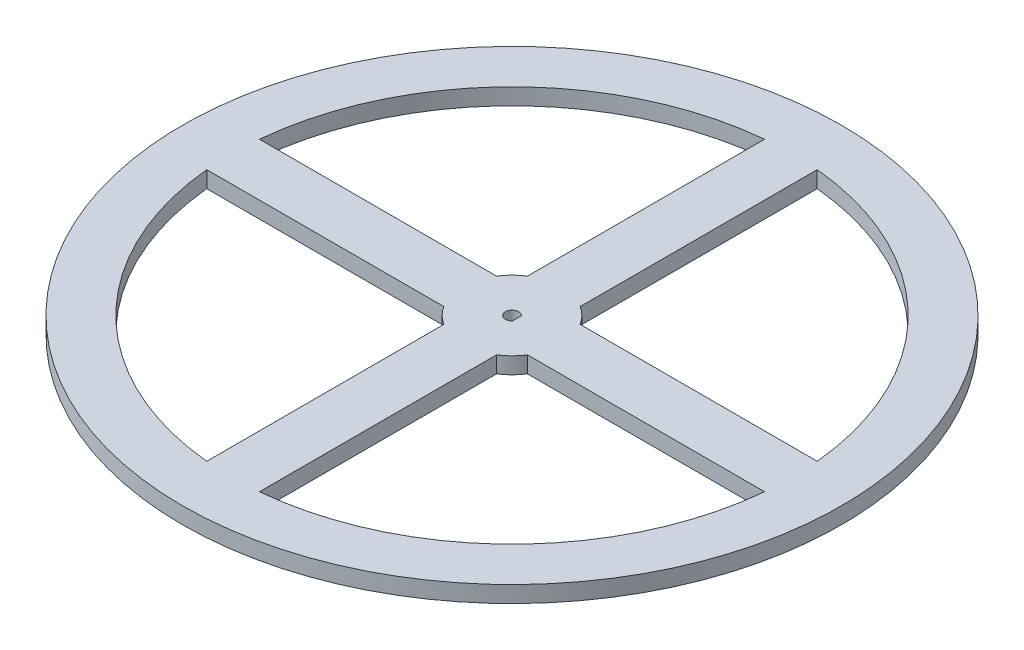
ISO-10303-21;
HEADER;
FILE_DESCRIPTION(('STEP AP214'),'2;1');
FILE_NAME('part.step','',(''),(''),'','','');
FILE_SCHEMA(('AUTOMOTIVE_DESIGN { 1 0 10303 214 1 1 1 1 }'));
ENDSEC;
DATA;
#1=APPLICATION_CONTEXT('core data for automotive mechanical design processes');
#2=APPLICATION_PROTOCOL_DEFINITION('international standard','automotive_design',2000,#1);
#3=PRODUCT_CONTEXT('',#1,'mechanical');
#4=PRODUCT('Part','Part','',(#3));
#5=PRODUCT_RELATED_PRODUCT_CATEGORY('part','',(#4));
#6=PRODUCT_DEFINITION_FORMATION('','',#4);
#7=PRODUCT_DEFINITION_CONTEXT('part definition',#1,'design');
#8=PRODUCT_DEFINITION('design','',#6,#7);
#9=PRODUCT_DEFINITION_SHAPE('','',#8);
#10=(LENGTH_UNIT() NAMED_UNIT(*) SI_UNIT(.MILLI.,.METRE.));
#11=(NAMED_UNIT(*) PLANE_ANGLE_UNIT() SI_UNIT($,.RADIAN.));
#12=(NAMED_UNIT(*) SI_UNIT($,.STERADIAN.) SOLID_ANGLE_UNIT());
#13=UNCERTAINTY_MEASURE_WITH_UNIT(LENGTH_MEASURE(1.E-05),#10,'distance_accuracy_value','');
#14=(GEOMETRIC_REPRESENTATION_CONTEXT(3) GLOBAL_UNCERTAINTY_ASSIGNED_CONTEXT((#13)) GLOBAL_UNIT_ASSIGNED_CONTEXT((#10,
#11,#12)) REPRESENTATION_CONTEXT('',''));
#15=CARTESIAN_POINT('',(0.,0.,0.));
#16=DIRECTION('',(0.,0.,1.));
#17=DIRECTION('',(1.,0.,0.));
#18=AXIS2_PLACEMENT_3D('',#15,#16,#17);
#19=CARTESIAN_POINT('',(0.,5.,0.));
#20=DIRECTION('',(0.,-1.,0.));
#21=DIRECTION('',(0.,0.,-1.));
#22=AXIS2_PLACEMENT_3D('',#19,#20,#21);
#23=CYLINDRICAL_SURFACE('',#22,85.);
#24=CARTESIAN_POINT('',(0.,0.,0.));
#25=DIRECTION('',(0.,1.,0.));
#26=DIRECTION('',(0.,0.,1.));
#27=AXIS2_PLACEMENT_3D('',#24,#25,#26);
#28=CIRCLE('',#27,85.);
#29=CARTESIAN_POINT('',(-8.00000000000001,0.,-84.6226919921601));
#30=VERTEX_POINT('',#29);
#31=CARTESIAN_POINT('',(-84.6226919921601,0.,-8.));
#32=VERTEX_POINT('',#31);
#33=EDGE_CURVE('E260',#30,#32,#28,.T.);
#34=ORIENTED_EDGE('',*,*,#33,.F.);
#35=DIRECTION('',(0.,-1.,0.));
#36=VECTOR('',#35,1.);
#37=CARTESIAN_POINT('',(-8.00000000000001,5.,-84.6226919921601));
#38=LINE('',#37,#36);
#39=CARTESIAN_POINT('',(-8.00000000000001,5.,-84.6226919921601));
#40=VERTEX_POINT('',#39);
#41=EDGE_CURVE('E11',#40,#30,#38,.T.);
#42=ORIENTED_EDGE('',*,*,#41,.F.);
#43=CARTESIAN_POINT('',(0.,5.,0.));
#44=DIRECTION('',(0.,1.,0.));
#45=DIRECTION('',(0.,0.,1.));
#46=AXIS2_PLACEMENT_3D('',#43,#44,#45);
#47=CIRCLE('',#46,85.);
#48=CARTESIAN_POINT('',(-84.6226919921601,5.,-8.));
#49=VERTEX_POINT('',#48);
#50=EDGE_CURVE('E212',#40,#49,#47,.T.);
#51=ORIENTED_EDGE('',*,*,#50,.T.);
#52=DIRECTION('',(0.,-1.,0.));
#53=VECTOR('',#52,1.);
#54=CARTESIAN_POINT('',(-84.6226919921601,5.,-8.));
#55=LINE('',#54,#53);
#56=EDGE_CURVE('E271',#49,#32,#55,.T.);
#57=ORIENTED_EDGE('',*,*,#56,.T.);
#58=EDGE_LOOP('',(#34,#42,#51,#57));
#59=FACE_BOUND('',#58,.T.);
#60=ADVANCED_FACE('F33',(#59),#23,.F.);
#61=CARTESIAN_POINT('',(-8.00000000000001,5.,0.));
#62=DIRECTION('',(-1.,0.,0.));
#63=DIRECTION('',(0.,0.,1.));
#64=AXIS2_PLACEMENT_3D('',#61,#62,#63);
#65=PLANE('',#64);
#66=DIRECTION('',(0.,0.,-1.));
#67=VECTOR('',#66,1.);
#68=CARTESIAN_POINT('',(-8.00000000000001,0.,0.));
#69=LINE('',#68,#67);
#70=CARTESIAN_POINT('',(-8.00000000000001,0.,-12.6885775404495));
#71=VERTEX_POINT('',#70);
#72=EDGE_CURVE('E263',#71,#30,#69,.T.);
#73=ORIENTED_EDGE('',*,*,#72,.F.);
#74=DIRECTION('',(0.,-1.,0.));
#75=VECTOR('',#74,1.);
#76=CARTESIAN_POINT('',(-8.00000000000001,5.,-12.6885775404495));
#77=LINE('',#76,#75);
#78=CARTESIAN_POINT('',(-8.00000000000001,5.,-12.6885775404495));
#79=VERTEX_POINT('',#78);
#80=EDGE_CURVE('E42',#79,#71,#77,.T.);
#81=ORIENTED_EDGE('',*,*,#80,.F.);
#82=DIRECTION('',(0.,0.,-1.));
#83=VECTOR('',#82,1.);
#84=CARTESIAN_POINT('',(-8.00000000000001,5.,0.));
#85=LINE('',#84,#83);
#86=EDGE_CURVE('E215',#79,#40,#85,.T.);
#87=ORIENTED_EDGE('',*,*,#86,.T.);
#88=ORIENTED_EDGE('',*,*,#41,.T.);
#89=EDGE_LOOP('',(#73,#81,#87,#88));
#90=FACE_BOUND('',#89,.T.);
#91=ADVANCED_FACE('F338',(#90),#65,.T.);
#92=CARTESIAN_POINT('',(0.,5.,0.));
#93=DIRECTION('',(0.,-1.,0.));
#94=DIRECTION('',(0.,0.,-1.));
#95=AXIS2_PLACEMENT_3D('',#92,#93,#94);
#96=CYLINDRICAL_SURFACE('',#95,15.);
#97=CARTESIAN_POINT('',(0.,0.,0.));
#98=DIRECTION('',(0.,1.,0.));
#99=DIRECTION('',(0.,0.,1.));
#100=AXIS2_PLACEMENT_3D('',#97,#98,#99);
#101=CIRCLE('',#100,15.);
#102=CARTESIAN_POINT('',(-12.6885775404495,0.,-8.));
#103=VERTEX_POINT('',#102);
#104=EDGE_CURVE('E266',#71,#103,#101,.T.);
#105=ORIENTED_EDGE('',*,*,#104,.T.);
#106=DIRECTION('',(0.,-1.,0.));
#107=VECTOR('',#106,1.);
#108=CARTESIAN_POINT('',(-12.6885775404495,5.,-8.));
#109=LINE('',#108,#107);
#110=CARTESIAN_POINT('',(-12.6885775404495,5.,-8.));
#111=VERTEX_POINT('',#110);
#112=EDGE_CURVE('E273',#111,#103,#109,.T.);
#113=ORIENTED_EDGE('',*,*,#112,.F.);
#114=CARTESIAN_POINT('',(0.,5.,0.));
#115=DIRECTION('',(0.,1.,0.));
#116=DIRECTION('',(0.,0.,1.));
#117=AXIS2_PLACEMENT_3D('',#114,#115,#116);
#118=CIRCLE('',#117,15.);
#119=EDGE_CURVE('E218',#79,#111,#118,.T.);
#120=ORIENTED_EDGE('',*,*,#119,.F.);
#121=ORIENTED_EDGE('',*,*,#80,.T.);
#122=EDGE_LOOP('',(#105,#113,#120,#121));
#123=FACE_BOUND('',#122,.T.);
#124=ADVANCED_FACE('F344',(#123),#96,.T.);
#125=CARTESIAN_POINT('',(-220.141421356237,5.,8.00000000000002));
#126=DIRECTION('',(0.,0.,1.));
#127=DIRECTION('',(1.,0.,0.));
#128=AXIS2_PLACEMENT_3D('',#125,#126,#127);
#129=PLANE('',#128);
#130=DIRECTION('',(-1.,0.,0.));
#131=VECTOR('',#130,1.);
#132=CARTESIAN_POINT('',(-220.141421356237,0.,8.00000000000002));
#133=LINE('',#132,#131);
#134=CARTESIAN_POINT('',(84.6226919921601,0.,8.));
#135=VERTEX_POINT('',#134);
#136=CARTESIAN_POINT('',(12.6885775404495,0.,8.00000000000001));
#137=VERTEX_POINT('',#136);
#138=EDGE_CURVE('E245',#135,#137,#133,.T.);
#139=ORIENTED_EDGE('',*,*,#138,.F.);
#140=DIRECTION('',(0.,-1.,0.));
#141=VECTOR('',#140,1.);
#142=CARTESIAN_POINT('',(84.6226919921601,5.,8.));
#143=LINE('',#142,#141);
#144=CARTESIAN_POINT('',(84.6226919921601,5.,8.));
#145=VERTEX_POINT('',#144);
#146=EDGE_CURVE('E274',#145,#135,#143,.T.);
#147=ORIENTED_EDGE('',*,*,#146,.F.);
#148=DIRECTION('',(-1.,0.,0.));
#149=VECTOR('',#148,1.);
#150=CARTESIAN_POINT('',(-220.141421356237,5.,8.00000000000002));
#151=LINE('',#150,#149);
#152=CARTESIAN_POINT('',(12.6885775404495,5.,8.00000000000001));
#153=VERTEX_POINT('',#152);
#154=EDGE_CURVE('E198',#145,#153,#151,.T.);
#155=ORIENTED_EDGE('',*,*,#154,.T.);
#156=DIRECTION('',(0.,-1.,0.));
#157=VECTOR('',#156,1.);
#158=CARTESIAN_POINT('',(12.6885775404495,5.,8.00000000000001));
#159=LINE('',#158,#157);
#160=EDGE_CURVE('E278',#153,#137,#159,.T.);
#161=ORIENTED_EDGE('',*,*,#160,.T.);
#162=EDGE_LOOP('',(#139,#147,#155,#161));
#163=FACE_BOUND('',#162,.T.);
#164=ADVANCED_FACE('F380',(#163),#129,.T.);
#165=CARTESIAN_POINT('',(0.,5.,0.));
#166=DIRECTION('',(0.,-1.,0.));
#167=DIRECTION('',(0.,0.,-1.));
#168=AXIS2_PLACEMENT_3D('',#165,#166,#167);
#169=CYLINDRICAL_SURFACE('',#168,85.);
#170=CARTESIAN_POINT('',(0.,0.,0.));
#171=DIRECTION('',(0.,1.,0.));
#172=DIRECTION('',(0.,0.,1.));
#173=AXIS2_PLACEMENT_3D('',#170,#171,#172);
#174=CIRCLE('',#173,85.);
#175=CARTESIAN_POINT('',(8.,0.,84.6226919921601));
#176=VERTEX_POINT('',#175);
#177=EDGE_CURVE('E248',#176,#135,#174,.T.);
#178=ORIENTED_EDGE('',*,*,#177,.F.);
#179=DIRECTION('',(0.,-1.,0.));
#180=VECTOR('',#179,1.);
#181=CARTESIAN_POINT('',(8.,5.,84.6226919921601));
#182=LINE('',#181,#180);
#183=CARTESIAN_POINT('',(8.,5.,84.6226919921601));
#184=VERTEX_POINT('',#183);
#185=EDGE_CURVE('E284',#184,#176,#182,.T.);
#186=ORIENTED_EDGE('',*,*,#185,.F.);
#187=CARTESIAN_POINT('',(0.,5.,0.));
#188=DIRECTION('',(0.,1.,0.));
#189=DIRECTION('',(0.,0.,1.));
#190=AXIS2_PLACEMENT_3D('',#187,#188,#189);
#191=CIRCLE('',#190,85.);
#192=EDGE_CURVE('E201',#184,#145,#191,.T.);
#193=ORIENTED_EDGE('',*,*,#192,.T.);
#194=ORIENTED_EDGE('',*,*,#146,.T.);
#195=EDGE_LOOP('',(#178,#186,#193,#194));
#196=FACE_BOUND('',#195,.T.);
#197=ADVANCED_FACE('F376',(#196),#169,.F.);
#198=CARTESIAN_POINT('',(8.00000000000001,5.,0.));
#199=DIRECTION('',(-1.,0.,0.));
#200=DIRECTION('',(0.,0.,1.));
#201=AXIS2_PLACEMENT_3D('',#198,#199,#200);
#202=PLANE('',#201);
#203=DIRECTION('',(0.,0.,-1.));
#204=VECTOR('',#203,1.);
#205=CARTESIAN_POINT('',(8.00000000000001,0.,0.));
#206=LINE('',#205,#204);
#207=CARTESIAN_POINT('',(8.00000000000001,0.,12.6885775404495));
#208=VERTEX_POINT('',#207);
#209=EDGE_CURVE('E251',#176,#208,#206,.T.);
#210=ORIENTED_EDGE('',*,*,#209,.T.);
#211=DIRECTION('',(0.,-1.,0.));
#212=VECTOR('',#211,1.);
#213=CARTESIAN_POINT('',(8.00000000000001,5.,12.6885775404495));
#214=LINE('',#213,#212);
#215=CARTESIAN_POINT('',(8.00000000000001,5.,12.6885775404495));
#216=VERTEX_POINT('',#215);
#217=EDGE_CURVE('E280',#216,#208,#214,.T.);
#218=ORIENTED_EDGE('',*,*,#217,.F.);
#219=DIRECTION('',(0.,0.,-1.));
#220=VECTOR('',#219,1.);
#221=CARTESIAN_POINT('',(8.00000000000001,5.,0.));
#222=LINE('',#221,#220);
#223=EDGE_CURVE('E204',#184,#216,#222,.T.);
#224=ORIENTED_EDGE('',*,*,#223,.F.);
#225=ORIENTED_EDGE('',*,*,#185,.T.);
#226=EDGE_LOOP('',(#210,#218,#224,#225));
#227=FACE_BOUND('',#226,.T.);
#228=ADVANCED_FACE('F372',(#227),#202,.F.);
#229=CARTESIAN_POINT('',(-8.00000000000001,5.,0.));
#230=DIRECTION('',(-1.,0.,0.));
#231=DIRECTION('',(0.,0.,1.));
#232=AXIS2_PLACEMENT_3D('',#229,#230,#231);
#233=PLANE('',#232);
#234=DIRECTION('',(0.,0.,-1.));
#235=VECTOR('',#234,1.);
#236=CARTESIAN_POINT('',(-8.00000000000001,0.,0.));
#237=LINE('',#236,#235);
#238=CARTESIAN_POINT('',(-8.,0.,84.6226919921601));
#239=VERTEX_POINT('',#238);
#240=CARTESIAN_POINT('',(-8.00000000000001,0.,12.6885775404495));
#241=VERTEX_POINT('',#240);
#242=EDGE_CURVE('E233',#239,#241,#237,.T.);
#243=ORIENTED_EDGE('',*,*,#242,.F.);
#244=DIRECTION('',(0.,-1.,0.));
#245=VECTOR('',#244,1.);
#246=CARTESIAN_POINT('',(-8.,5.,84.6226919921601));
#247=LINE('',#246,#245);
#248=CARTESIAN_POINT('',(-8.,5.,84.6226919921601));
#249=VERTEX_POINT('',#248);
#250=EDGE_CURVE('E281',#249,#239,#247,.T.);
#251=ORIENTED_EDGE('',*,*,#250,.F.);
#252=DIRECTION('',(0.,0.,-1.));
#253=VECTOR('',#252,1.);
#254=CARTESIAN_POINT('',(-8.00000000000001,5.,0.));
#255=LINE('',#254,#253);
#256=CARTESIAN_POINT('',(-8.00000000000001,5.,12.6885775404495));
#257=VERTEX_POINT('',#256);
#258=EDGE_CURVE('E187',#249,#257,#255,.T.);
#259=ORIENTED_EDGE('',*,*,#258,.T.);
#260=DIRECTION('',(0.,-1.,0.));
#261=VECTOR('',#260,1.);
#262=CARTESIAN_POINT('',(-8.00000000000001,5.,12.6885775404495));
#263=LINE('',#262,#261);
#264=EDGE_CURVE('E287',#257,#241,#263,.T.);
#265=ORIENTED_EDGE('',*,*,#264,.T.);
#266=EDGE_LOOP('',(#243,#251,#259,#265));
#267=FACE_BOUND('',#266,.T.);
#268=ADVANCED_FACE('F375',(#267),#233,.T.);
#269=CARTESIAN_POINT('',(0.,5.,0.));
#270=DIRECTION('',(0.,-1.,0.));
#271=DIRECTION('',(0.,0.,-1.));
#272=AXIS2_PLACEMENT_3D('',#269,#270,#271);
#273=CYLINDRICAL_SURFACE('',#272,85.);
#274=CARTESIAN_POINT('',(0.,0.,0.));
#275=DIRECTION('',(0.,1.,0.));
#276=DIRECTION('',(0.,0.,1.));
#277=AXIS2_PLACEMENT_3D('',#274,#275,#276);
#278=CIRCLE('',#277,85.);
#279=CARTESIAN_POINT('',(-84.6226919921601,0.,8.));
#280=VERTEX_POINT('',#279);
#281=EDGE_CURVE('E236',#280,#239,#278,.T.);
#282=ORIENTED_EDGE('',*,*,#281,.F.);
#283=DIRECTION('',(0.,-1.,0.));
#284=VECTOR('',#283,1.);
#285=CARTESIAN_POINT('',(-84.6226919921601,5.,8.));
#286=LINE('',#285,#284);
#287=CARTESIAN_POINT('',(-84.6226919921601,5.,8.));
#288=VERTEX_POINT('',#287);
#289=EDGE_CURVE('E291',#288,#280,#286,.T.);
#290=ORIENTED_EDGE('',*,*,#289,.F.);
#291=CARTESIAN_POINT('',(0.,5.,0.));
#292=DIRECTION('',(0.,1.,0.));
#293=DIRECTION('',(0.,0.,1.));
#294=AXIS2_PLACEMENT_3D('',#291,#292,#293);
#295=CIRCLE('',#294,85.);
#296=EDGE_CURVE('E190',#288,#249,#295,.T.);
#297=ORIENTED_EDGE('',*,*,#296,.T.);
#298=ORIENTED_EDGE('',*,*,#250,.T.);
#299=EDGE_LOOP('',(#282,#290,#297,#298));
#300=FACE_BOUND('',#299,.T.);
#301=ADVANCED_FACE('F391',(#300),#273,.F.);
#302=CARTESIAN_POINT('',(-220.141421356237,5.,7.99999999999999));
#303=DIRECTION('',(0.,0.,1.));
#304=DIRECTION('',(1.,0.,0.));
#305=AXIS2_PLACEMENT_3D('',#302,#303,#304);
#306=PLANE('',#305);
#307=DIRECTION('',(-1.,0.,0.));
#308=VECTOR('',#307,1.);
#309=CARTESIAN_POINT('',(-220.141421356237,0.,7.99999999999999));
#310=LINE('',#309,#308);
#311=CARTESIAN_POINT('',(-12.6885775404495,0.,8.));
#312=VERTEX_POINT('',#311);
#313=EDGE_CURVE('E239',#312,#280,#310,.T.);
#314=ORIENTED_EDGE('',*,*,#313,.F.);
#315=DIRECTION('',(0.,-1.,0.));
#316=VECTOR('',#315,1.);
#317=CARTESIAN_POINT('',(-12.6885775404495,5.,8.));
#318=LINE('',#317,#316);
#319=CARTESIAN_POINT('',(-12.6885775404495,5.,8.));
#320=VERTEX_POINT('',#319);
#321=EDGE_CURVE('E289',#320,#312,#318,.T.);
#322=ORIENTED_EDGE('',*,*,#321,.F.);
#323=DIRECTION('',(-1.,0.,0.));
#324=VECTOR('',#323,1.);
#325=CARTESIAN_POINT('',(-220.141421356237,5.,7.99999999999999));
#326=LINE('',#325,#324);
#327=EDGE_CURVE('E193',#320,#288,#326,.T.);
#328=ORIENTED_EDGE('',*,*,#327,.T.);
#329=ORIENTED_EDGE('',*,*,#289,.T.);
#330=EDGE_LOOP('',(#314,#322,#328,#329));
#331=FACE_BOUND('',#330,.T.);
#332=ADVANCED_FACE('F388',(#331),#306,.T.);
#333=CARTESIAN_POINT('',(0.,5.,0.));
#334=DIRECTION('',(0.,-1.,0.));
#335=DIRECTION('',(0.,0.,-1.));
#336=AXIS2_PLACEMENT_3D('',#333,#334,#335);
#337=CYLINDRICAL_SURFACE('',#336,85.);
#338=CARTESIAN_POINT('',(0.,0.,0.));
#339=DIRECTION('',(0.,1.,0.));
#340=DIRECTION('',(0.,0.,1.));
#341=AXIS2_PLACEMENT_3D('',#338,#339,#340);
#342=CIRCLE('',#341,85.);
#343=CARTESIAN_POINT('',(84.6226919921601,0.,-8.));
#344=VERTEX_POINT('',#343);
#345=CARTESIAN_POINT('',(8.,0.,-84.6226919921601));
#346=VERTEX_POINT('',#345);
#347=EDGE_CURVE('E175',#344,#346,#342,.T.);
#348=ORIENTED_EDGE('',*,*,#347,.F.);
#349=DIRECTION('',(0.,-1.,0.));
#350=VECTOR('',#349,1.);
#351=CARTESIAN_POINT('',(84.6226919921601,5.,-8.));
#352=LINE('',#351,#350);
#353=CARTESIAN_POINT('',(84.6226919921601,5.,-8.));
#354=VERTEX_POINT('',#353);
#355=EDGE_CURVE('E37',#354,#344,#352,.T.);
#356=ORIENTED_EDGE('',*,*,#355,.F.);
#357=CARTESIAN_POINT('',(0.,5.,0.));
#358=DIRECTION('',(0.,1.,0.));
#359=DIRECTION('',(0.,0.,1.));
#360=AXIS2_PLACEMENT_3D('',#357,#358,#359);
#361=CIRCLE('',#360,85.);
#362=CARTESIAN_POINT('',(8.,5.,-84.6226919921601));
#363=VERTEX_POINT('',#362);
#364=EDGE_CURVE('E177',#354,#363,#361,.T.);
#365=ORIENTED_EDGE('',*,*,#364,.T.);
#366=DIRECTION('',(0.,-1.,0.));
#367=VECTOR('',#366,1.);
#368=CARTESIAN_POINT('',(8.,5.,-84.6226919921601));
#369=LINE('',#368,#367);
#370=EDGE_CURVE('E223',#363,#346,#369,.T.);
#371=ORIENTED_EDGE('',*,*,#370,.T.);
#372=EDGE_LOOP('',(#348,#356,#365,#371));
#373=FACE_BOUND('',#372,.T.);
#374=ADVANCED_FACE('F35',(#373),#337,.F.);
#375=CARTESIAN_POINT('',(-220.141421356237,5.,-8.00000000000001));
#376=DIRECTION('',(0.,0.,1.));
#377=DIRECTION('',(1.,0.,0.));
#378=AXIS2_PLACEMENT_3D('',#375,#376,#377);
#379=PLANE('',#378);
#380=DIRECTION('',(-1.,0.,0.));
#381=VECTOR('',#380,1.);
#382=CARTESIAN_POINT('',(-220.141421356237,0.,-8.00000000000001));
#383=LINE('',#382,#381);
#384=CARTESIAN_POINT('',(12.6885775404495,0.,-8.));
#385=VERTEX_POINT('',#384);
#386=EDGE_CURVE('E226',#344,#385,#383,.T.);
#387=ORIENTED_EDGE('',*,*,#386,.T.);
#388=DIRECTION('',(0.,-1.,0.));
#389=VECTOR('',#388,1.);
#390=CARTESIAN_POINT('',(12.6885775404495,5.,-8.));
#391=LINE('',#390,#389);
#392=CARTESIAN_POINT('',(12.6885775404495,5.,-8.));
#393=VERTEX_POINT('',#392);
#394=EDGE_CURVE('E297',#393,#385,#391,.T.);
#395=ORIENTED_EDGE('',*,*,#394,.F.);
#396=DIRECTION('',(-1.,0.,0.));
#397=VECTOR('',#396,1.);
#398=CARTESIAN_POINT('',(-220.141421356237,5.,-8.00000000000001));
#399=LINE('',#398,#397);
#400=EDGE_CURVE('E180',#354,#393,#399,.T.);
#401=ORIENTED_EDGE('',*,*,#400,.F.);
#402=ORIENTED_EDGE('',*,*,#355,.T.);
#403=EDGE_LOOP('',(#387,#395,#401,#402));
#404=FACE_BOUND('',#403,.T.);
#405=ADVANCED_FACE('F306',(#404),#379,.F.);
#406=CARTESIAN_POINT('',(0.,5.,0.));
#407=DIRECTION('',(0.,-1.,0.));
#408=DIRECTION('',(0.,0.,-1.));
#409=AXIS2_PLACEMENT_3D('',#406,#407,#408);
#410=CYLINDRICAL_SURFACE('',#409,15.);
#411=CARTESIAN_POINT('',(0.,0.,0.));
#412=DIRECTION('',(0.,1.,0.));
#413=DIRECTION('',(0.,0.,1.));
#414=AXIS2_PLACEMENT_3D('',#411,#412,#413);
#415=CIRCLE('',#414,15.);
#416=CARTESIAN_POINT('',(8.00000000000001,0.,-12.6885775404495));
#417=VERTEX_POINT('',#416);
#418=EDGE_CURVE('E228',#385,#417,#415,.T.);
#419=ORIENTED_EDGE('',*,*,#418,.T.);
#420=DIRECTION('',(0.,-1.,0.));
#421=VECTOR('',#420,1.);
#422=CARTESIAN_POINT('',(8.00000000000001,5.,-12.6885775404495));
#423=LINE('',#422,#421);
#424=CARTESIAN_POINT('',(8.00000000000001,5.,-12.6885775404495));
#425=VERTEX_POINT('',#424);
#426=EDGE_CURVE('E295',#425,#417,#423,.T.);
#427=ORIENTED_EDGE('',*,*,#426,.F.);
#428=CARTESIAN_POINT('',(0.,5.,0.));
#429=DIRECTION('',(0.,1.,0.));
#430=DIRECTION('',(0.,0.,1.));
#431=AXIS2_PLACEMENT_3D('',#428,#429,#430);
#432=CIRCLE('',#431,15.);
#433=EDGE_CURVE('E183',#393,#425,#432,.T.);
#434=ORIENTED_EDGE('',*,*,#433,.F.);
#435=ORIENTED_EDGE('',*,*,#394,.T.);
#436=EDGE_LOOP('',(#419,#427,#434,#435));
#437=FACE_BOUND('',#436,.T.);
#438=ADVANCED_FACE('F319',(#437),#410,.T.);
#439=CARTESIAN_POINT('',(0.,5.,0.));
#440=DIRECTION('',(0.,-1.,0.));
#441=DIRECTION('',(0.,0.,-1.));
#442=AXIS2_PLACEMENT_3D('',#439,#440,#441);
#443=CYLINDRICAL_SURFACE('',#442,100.);
#444=CARTESIAN_POINT('',(0.,5.,0.));
#445=DIRECTION('',(0.,1.,0.));
#446=DIRECTION('',(0.,0.,1.));
#447=AXIS2_PLACEMENT_3D('',#444,#445,#446);
#448=CIRCLE('',#447,100.);
#449=CARTESIAN_POINT('',(0.,5.,100.));
#450=VERTEX_POINT('',#449);
#451=EDGE_CURVE('E209',#450,#450,#448,.T.);
#452=ORIENTED_EDGE('',*,*,#451,.F.);
#453=EDGE_LOOP('',(#452));
#454=FACE_BOUND('',#453,.T.);
#455=CARTESIAN_POINT('',(0.,0.,0.));
#456=DIRECTION('',(0.,1.,0.));
#457=DIRECTION('',(0.,0.,1.));
#458=AXIS2_PLACEMENT_3D('',#455,#456,#457);
#459=CIRCLE('',#458,100.);
#460=CARTESIAN_POINT('',(0.,0.,100.));
#461=VERTEX_POINT('',#460);
#462=EDGE_CURVE('E257',#461,#461,#459,.T.);
#463=ORIENTED_EDGE('',*,*,#462,.T.);
#464=EDGE_LOOP('',(#463));
#465=FACE_BOUND('',#464,.T.);
#466=ADVANCED_FACE('F363',(#454,#465),#443,.T.);
#467=CARTESIAN_POINT('',(0.,5.,0.));
#468=DIRECTION('',(0.,-1.,0.));
#469=DIRECTION('',(0.,0.,-1.));
#470=AXIS2_PLACEMENT_3D('',#467,#468,#469);
#471=CYLINDRICAL_SURFACE('',#470,15.);
#472=CARTESIAN_POINT('',(0.,0.,0.));
#473=DIRECTION('',(0.,1.,0.));
#474=DIRECTION('',(0.,0.,1.));
#475=AXIS2_PLACEMENT_3D('',#472,#473,#474);
#476=CIRCLE('',#475,15.);
#477=EDGE_CURVE('E254',#208,#137,#476,.T.);
#478=ORIENTED_EDGE('',*,*,#477,.T.);
#479=ORIENTED_EDGE('',*,*,#160,.F.);
#480=CARTESIAN_POINT('',(0.,5.,0.));
#481=DIRECTION('',(0.,1.,0.));
#482=DIRECTION('',(0.,0.,1.));
#483=AXIS2_PLACEMENT_3D('',#480,#481,#482);
#484=CIRCLE('',#483,15.);
#485=EDGE_CURVE('E207',#216,#153,#484,.T.);
#486=ORIENTED_EDGE('',*,*,#485,.F.);
#487=ORIENTED_EDGE('',*,*,#217,.T.);
#488=EDGE_LOOP('',(#478,#479,#486,#487));
#489=FACE_BOUND('',#488,.T.);
#490=ADVANCED_FACE('F366',(#489),#471,.T.);
#491=CARTESIAN_POINT('',(0.,5.,0.));
#492=DIRECTION('',(0.,-1.,0.));
#493=DIRECTION('',(0.,0.,-1.));
#494=AXIS2_PLACEMENT_3D('',#491,#492,#493);
#495=CYLINDRICAL_SURFACE('',#494,15.);
#496=CARTESIAN_POINT('',(0.,0.,0.));
#497=DIRECTION('',(0.,1.,0.));
#498=DIRECTION('',(0.,0.,1.));
#499=AXIS2_PLACEMENT_3D('',#496,#497,#498);
#500=CIRCLE('',#499,15.);
#501=EDGE_CURVE('E242',#312,#241,#500,.T.);
#502=ORIENTED_EDGE('',*,*,#501,.T.);
#503=ORIENTED_EDGE('',*,*,#264,.F.);
#504=CARTESIAN_POINT('',(0.,5.,0.));
#505=DIRECTION('',(0.,1.,0.));
#506=DIRECTION('',(0.,0.,1.));
#507=AXIS2_PLACEMENT_3D('',#504,#505,#506);
#508=CIRCLE('',#507,15.);
#509=EDGE_CURVE('E196',#320,#257,#508,.T.);
#510=ORIENTED_EDGE('',*,*,#509,.F.);
#511=ORIENTED_EDGE('',*,*,#321,.T.);
#512=EDGE_LOOP('',(#502,#503,#510,#511));
#513=FACE_BOUND('',#512,.T.);
#514=ADVANCED_FACE('F370',(#513),#495,.T.);
#515=CARTESIAN_POINT('',(8.00000000000001,5.,0.));
#516=DIRECTION('',(-1.,0.,0.));
#517=DIRECTION('',(0.,0.,1.));
#518=AXIS2_PLACEMENT_3D('',#515,#516,#517);
#519=PLANE('',#518);
#520=DIRECTION('',(0.,0.,-1.));
#521=VECTOR('',#520,1.);
#522=CARTESIAN_POINT('',(8.00000000000001,0.,0.));
#523=LINE('',#522,#521);
#524=EDGE_CURVE('E230',#417,#346,#523,.T.);
#525=ORIENTED_EDGE('',*,*,#524,.T.);
#526=ORIENTED_EDGE('',*,*,#370,.F.);
#527=DIRECTION('',(0.,0.,-1.));
#528=VECTOR('',#527,1.);
#529=CARTESIAN_POINT('',(8.00000000000001,5.,0.));
#530=LINE('',#529,#528);
#531=EDGE_CURVE('E185',#425,#363,#530,.T.);
#532=ORIENTED_EDGE('',*,*,#531,.F.);
#533=ORIENTED_EDGE('',*,*,#426,.T.);
#534=EDGE_LOOP('',(#525,#526,#532,#533));
#535=FACE_BOUND('',#534,.T.);
#536=ADVANCED_FACE('F317',(#535),#519,.F.);
#537=CARTESIAN_POINT('',(-220.141421356237,5.,-8.));
#538=DIRECTION('',(0.,0.,1.));
#539=DIRECTION('',(1.,0.,0.));
#540=AXIS2_PLACEMENT_3D('',#537,#538,#539);
#541=PLANE('',#540);
#542=DIRECTION('',(-1.,0.,0.));
#543=VECTOR('',#542,1.);
#544=CARTESIAN_POINT('',(-220.141421356237,0.,-8.));
#545=LINE('',#544,#543);
#546=EDGE_CURVE('E181',#103,#32,#545,.T.);
#547=ORIENTED_EDGE('',*,*,#546,.T.);
#548=ORIENTED_EDGE('',*,*,#56,.F.);
#549=DIRECTION('',(-1.,0.,0.));
#550=VECTOR('',#549,1.);
#551=CARTESIAN_POINT('',(-220.141421356237,5.,-8.));
#552=LINE('',#551,#550);
#553=EDGE_CURVE('E221',#111,#49,#552,.T.);
#554=ORIENTED_EDGE('',*,*,#553,.F.);
#555=ORIENTED_EDGE('',*,*,#112,.T.);
#556=EDGE_LOOP('',(#547,#548,#554,#555));
#557=FACE_BOUND('',#556,.T.);
#558=ADVANCED_FACE('F322',(#557),#541,.F.);
#559=CARTESIAN_POINT('',(-220.141421356237,5.,0.));
#560=DIRECTION('',(0.,1.,0.));
#561=DIRECTION('',(0.,0.,1.));
#562=AXIS2_PLACEMENT_3D('',#559,#560,#561);
#563=PLANE('',#562);
#564=DIRECTION('',(0.,0.,1.));
#565=VECTOR('',#564,1.);
#566=CARTESIAN_POINT('',(1.5,5.,0.));
#567=LINE('',#566,#565);
#568=CARTESIAN_POINT('',(1.5,5.,-1.3228756555323));
#569=VERTEX_POINT('',#568);
#570=CARTESIAN_POINT('',(1.5,5.,1.3228756555323));
#571=VERTEX_POINT('',#570);
#572=EDGE_CURVE('E158',#569,#571,#567,.T.);
#573=ORIENTED_EDGE('',*,*,#572,.T.);
#574=CARTESIAN_POINT('',(0.,5.,0.));
#575=DIRECTION('',(0.,-1.,0.));
#576=DIRECTION('',(0.,0.,-1.));
#577=AXIS2_PLACEMENT_3D('',#574,#575,#576);
#578=CIRCLE('',#577,2.);
#579=EDGE_CURVE('E163',#571,#569,#578,.T.);
#580=ORIENTED_EDGE('',*,*,#579,.T.);
#581=EDGE_LOOP('',(#573,#580));
#582=FACE_BOUND('',#581,.T.);
#583=ORIENTED_EDGE('',*,*,#364,.F.);
#584=ORIENTED_EDGE('',*,*,#400,.T.);
#585=ORIENTED_EDGE('',*,*,#433,.T.);
#586=ORIENTED_EDGE('',*,*,#531,.T.);
#587=EDGE_LOOP('',(#583,#584,#585,#586));
#588=FACE_BOUND('',#587,.T.);
#589=ORIENTED_EDGE('',*,*,#258,.F.);
#590=ORIENTED_EDGE('',*,*,#296,.F.);
#591=ORIENTED_EDGE('',*,*,#327,.F.);
#592=ORIENTED_EDGE('',*,*,#509,.T.);
#593=EDGE_LOOP('',(#589,#590,#591,#592));
#594=FACE_BOUND('',#593,.T.);
#595=ORIENTED_EDGE('',*,*,#154,.F.);
#596=ORIENTED_EDGE('',*,*,#192,.F.);
#597=ORIENTED_EDGE('',*,*,#223,.T.);
#598=ORIENTED_EDGE('',*,*,#485,.T.);
#599=EDGE_LOOP('',(#595,#596,#597,#598));
#600=FACE_BOUND('',#599,.T.);
#601=ORIENTED_EDGE('',*,*,#451,.T.);
#602=EDGE_LOOP('',(#601));
#603=FACE_BOUND('',#602,.T.);
#604=ORIENTED_EDGE('',*,*,#50,.F.);
#605=ORIENTED_EDGE('',*,*,#86,.F.);
#606=ORIENTED_EDGE('',*,*,#119,.T.);
#607=ORIENTED_EDGE('',*,*,#553,.T.);
#608=EDGE_LOOP('',(#604,#605,#606,#607));
#609=FACE_BOUND('',#608,.T.);
#610=ADVANCED_FACE('F168',(#582,#588,#594,#600,#603,#609),#563,.T.);
#611=CARTESIAN_POINT('',(-220.141421356237,0.,0.));
#612=DIRECTION('',(0.,1.,0.));
#613=DIRECTION('',(0.,0.,1.));
#614=AXIS2_PLACEMENT_3D('',#611,#612,#613);
#615=PLANE('',#614);
#616=CARTESIAN_POINT('',(0.,0.,0.));
#617=DIRECTION('',(0.,-1.,0.));
#618=DIRECTION('',(0.,0.,-1.));
#619=AXIS2_PLACEMENT_3D('',#616,#617,#618);
#620=CIRCLE('',#619,2.);
#621=CARTESIAN_POINT('',(1.5,0.,1.3228756555323));
#622=VERTEX_POINT('',#621);
#623=CARTESIAN_POINT('',(1.5,0.,-1.3228756555323));
#624=VERTEX_POINT('',#623);
#625=EDGE_CURVE('E171',#622,#624,#620,.T.);
#626=ORIENTED_EDGE('',*,*,#625,.F.);
#627=DIRECTION('',(0.,0.,1.));
#628=VECTOR('',#627,1.);
#629=CARTESIAN_POINT('',(1.5,0.,0.));
#630=LINE('',#629,#628);
#631=EDGE_CURVE('E161',#624,#622,#630,.T.);
#632=ORIENTED_EDGE('',*,*,#631,.F.);
#633=EDGE_LOOP('',(#626,#632));
#634=FACE_BOUND('',#633,.T.);
#635=ORIENTED_EDGE('',*,*,#347,.T.);
#636=ORIENTED_EDGE('',*,*,#524,.F.);
#637=ORIENTED_EDGE('',*,*,#418,.F.);
#638=ORIENTED_EDGE('',*,*,#386,.F.);
#639=EDGE_LOOP('',(#635,#636,#637,#638));
#640=FACE_BOUND('',#639,.T.);
#641=ORIENTED_EDGE('',*,*,#242,.T.);
#642=ORIENTED_EDGE('',*,*,#501,.F.);
#643=ORIENTED_EDGE('',*,*,#313,.T.);
#644=ORIENTED_EDGE('',*,*,#281,.T.);
#645=EDGE_LOOP('',(#641,#642,#643,#644));
#646=FACE_BOUND('',#645,.T.);
#647=ORIENTED_EDGE('',*,*,#138,.T.);
#648=ORIENTED_EDGE('',*,*,#477,.F.);
#649=ORIENTED_EDGE('',*,*,#209,.F.);
#650=ORIENTED_EDGE('',*,*,#177,.T.);
#651=EDGE_LOOP('',(#647,#648,#649,#650));
#652=FACE_BOUND('',#651,.T.);
#653=ORIENTED_EDGE('',*,*,#462,.F.);
#654=EDGE_LOOP('',(#653));
#655=FACE_BOUND('',#654,.T.);
#656=ORIENTED_EDGE('',*,*,#33,.T.);
#657=ORIENTED_EDGE('',*,*,#546,.F.);
#658=ORIENTED_EDGE('',*,*,#104,.F.);
#659=ORIENTED_EDGE('',*,*,#72,.T.);
#660=EDGE_LOOP('',(#656,#657,#658,#659));
#661=FACE_BOUND('',#660,.T.);
#662=ADVANCED_FACE('F311',(#634,#640,#646,#652,#655,#661),#615,.F.);
#663=CARTESIAN_POINT('',(1.5,5.,0.));
#664=DIRECTION('',(1.,0.,0.));
#665=DIRECTION('',(0.,0.,-1.));
#666=AXIS2_PLACEMENT_3D('',#663,#664,#665);
#667=PLANE('',#666);
#668=ORIENTED_EDGE('',*,*,#631,.T.);
#669=DIRECTION('',(0.,-1.,0.));
#670=VECTOR('',#669,1.);
#671=CARTESIAN_POINT('',(1.5,5.,1.3228756555323));
#672=LINE('',#671,#670);
#673=EDGE_CURVE('E55',#571,#622,#672,.T.);
#674=ORIENTED_EDGE('',*,*,#673,.F.);
#675=ORIENTED_EDGE('',*,*,#572,.F.);
#676=DIRECTION('',(0.,-1.,0.));
#677=VECTOR('',#676,1.);
#678=CARTESIAN_POINT('',(1.5,5.,-1.3228756555323));
#679=LINE('',#678,#677);
#680=EDGE_CURVE('E50',#569,#624,#679,.T.);
#681=ORIENTED_EDGE('',*,*,#680,.T.);
#682=EDGE_LOOP('',(#668,#674,#675,#681));
#683=FACE_BOUND('',#682,.T.);
#684=ADVANCED_FACE('F156',(#683),#667,.F.);
#685=CARTESIAN_POINT('',(0.,5.,0.));
#686=DIRECTION('',(0.,-1.,0.));
#687=DIRECTION('',(0.,0.,-1.));
#688=AXIS2_PLACEMENT_3D('',#685,#686,#687);
#689=CYLINDRICAL_SURFACE('',#688,2.);
#690=ORIENTED_EDGE('',*,*,#625,.T.);
#691=ORIENTED_EDGE('',*,*,#680,.F.);
#692=ORIENTED_EDGE('',*,*,#579,.F.);
#693=ORIENTED_EDGE('',*,*,#673,.T.);
#694=EDGE_LOOP('',(#690,#691,#692,#693));
#695=FACE_BOUND('',#694,.T.);
#696=ADVANCED_FACE('F165',(#695),#689,.F.);
#697=CLOSED_SHELL('',(#60,#91,#124,#164,#197,#228,#268,#301,#332,#374,#405,#438,#466,#490,#514,
#536,#558,#610,#662,#684,#696));
#698=MANIFOLD_SOLID_BREP('B2',#697);
#699=ADVANCED_BREP_SHAPE_REPRESENTATION('',(#18,#698),#14);
#700=SHAPE_DEFINITION_REPRESENTATION(#9,#699);
ENDSEC;
END-ISO-10303-21;
